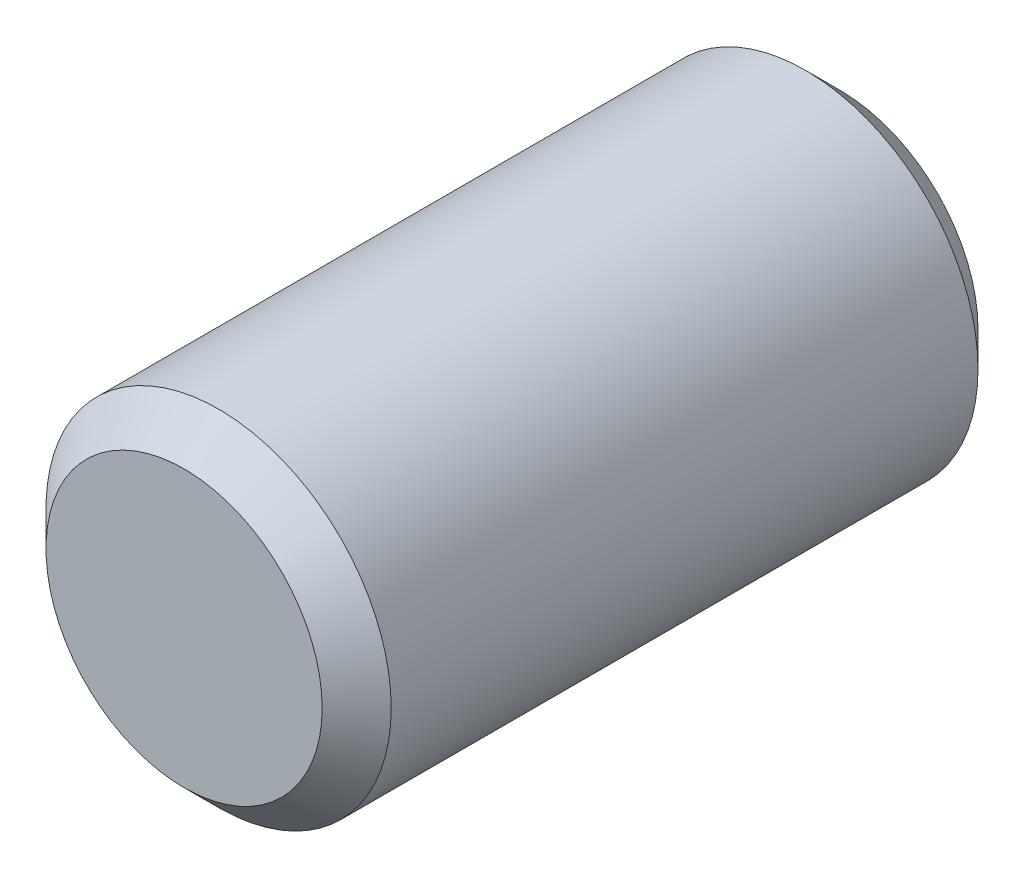
ISO-10303-21;
HEADER;
FILE_DESCRIPTION(('STEP AP214'),'2;1');
FILE_NAME('part.step','',(''),(''),'','','');
FILE_SCHEMA(('AUTOMOTIVE_DESIGN { 1 0 10303 214 1 1 1 1 }'));
ENDSEC;
DATA;
#1=APPLICATION_CONTEXT('core data for automotive mechanical design processes');
#2=APPLICATION_PROTOCOL_DEFINITION('international standard','automotive_design',2000,#1);
#3=PRODUCT_CONTEXT('',#1,'mechanical');
#4=PRODUCT('Part','Part','',(#3));
#5=PRODUCT_RELATED_PRODUCT_CATEGORY('part','',(#4));
#6=PRODUCT_DEFINITION_FORMATION('','',#4);
#7=PRODUCT_DEFINITION_CONTEXT('part definition',#1,'design');
#8=PRODUCT_DEFINITION('design','',#6,#7);
#9=PRODUCT_DEFINITION_SHAPE('','',#8);
#10=(LENGTH_UNIT() NAMED_UNIT(*) SI_UNIT(.MILLI.,.METRE.));
#11=(NAMED_UNIT(*) PLANE_ANGLE_UNIT() SI_UNIT($,.RADIAN.));
#12=(NAMED_UNIT(*) SI_UNIT($,.STERADIAN.) SOLID_ANGLE_UNIT());
#13=UNCERTAINTY_MEASURE_WITH_UNIT(LENGTH_MEASURE(1.E-05),#10,'distance_accuracy_value','');
#14=(GEOMETRIC_REPRESENTATION_CONTEXT(3) GLOBAL_UNCERTAINTY_ASSIGNED_CONTEXT((#13)) GLOBAL_UNIT_ASSIGNED_CONTEXT((#10,
#11,#12)) REPRESENTATION_CONTEXT('',''));
#15=CARTESIAN_POINT('',(0.,0.,0.));
#16=DIRECTION('',(0.,0.,1.));
#17=DIRECTION('',(1.,0.,0.));
#18=AXIS2_PLACEMENT_3D('',#15,#16,#17);
#19=CARTESIAN_POINT('',(0.,0.,190.));
#20=DIRECTION('',(0.,0.,-1.));
#21=DIRECTION('',(-1.,0.,0.));
#22=AXIS2_PLACEMENT_3D('',#19,#20,#21);
#23=CYLINDRICAL_SURFACE('',#22,50.);
#24=CARTESIAN_POINT('',(0.,0.,10.));
#25=DIRECTION('',(0.,0.,1.));
#26=DIRECTION('',(1.,0.,0.));
#27=AXIS2_PLACEMENT_3D('',#24,#25,#26);
#28=CIRCLE('',#27,50.);
#29=CARTESIAN_POINT('',(50.,0.,10.));
#30=VERTEX_POINT('',#29);
#31=EDGE_CURVE('E54',#30,#30,#28,.T.);
#32=ORIENTED_EDGE('',*,*,#31,.T.);
#33=EDGE_LOOP('',(#32));
#34=FACE_BOUND('',#33,.T.);
#35=CARTESIAN_POINT('',(0.,0.,180.));
#36=DIRECTION('',(0.,0.,1.));
#37=DIRECTION('',(1.,0.,0.));
#38=AXIS2_PLACEMENT_3D('',#35,#36,#37);
#39=CIRCLE('',#38,50.);
#40=CARTESIAN_POINT('',(50.,0.,180.));
#41=VERTEX_POINT('',#40);
#42=EDGE_CURVE('E58',#41,#41,#39,.F.);
#43=ORIENTED_EDGE('',*,*,#42,.T.);
#44=EDGE_LOOP('',(#43));
#45=FACE_BOUND('',#44,.T.);
#46=ADVANCED_FACE('F43',(#34,#45),#23,.T.);
#47=CARTESIAN_POINT('',(0.,0.,190.));
#48=DIRECTION('',(0.,0.,1.));
#49=DIRECTION('',(1.,0.,0.));
#50=AXIS2_PLACEMENT_3D('',#47,#48,#49);
#51=PLANE('',#50);
#52=CARTESIAN_POINT('',(0.,0.,190.));
#53=DIRECTION('',(0.,0.,1.));
#54=DIRECTION('',(1.,0.,0.));
#55=AXIS2_PLACEMENT_3D('',#52,#53,#54);
#56=CIRCLE('',#55,40.);
#57=CARTESIAN_POINT('',(40.,0.,190.));
#58=VERTEX_POINT('',#57);
#59=EDGE_CURVE('E12',#58,#58,#56,.T.);
#60=ORIENTED_EDGE('',*,*,#59,.T.);
#61=EDGE_LOOP('',(#60));
#62=FACE_BOUND('',#61,.T.);
#63=ADVANCED_FACE('F74',(#62),#51,.T.);
#64=CARTESIAN_POINT('',(0.,0.,0.));
#65=DIRECTION('',(0.,0.,1.));
#66=DIRECTION('',(1.,0.,0.));
#67=AXIS2_PLACEMENT_3D('',#64,#65,#66);
#68=PLANE('',#67);
#69=CARTESIAN_POINT('',(0.,0.,0.));
#70=DIRECTION('',(0.,0.,1.));
#71=DIRECTION('',(1.,0.,0.));
#72=AXIS2_PLACEMENT_3D('',#69,#70,#71);
#73=CIRCLE('',#72,40.);
#74=CARTESIAN_POINT('',(40.,0.,0.));
#75=VERTEX_POINT('',#74);
#76=EDGE_CURVE('E50',#75,#75,#73,.F.);
#77=ORIENTED_EDGE('',*,*,#76,.T.);
#78=EDGE_LOOP('',(#77));
#79=FACE_BOUND('',#78,.T.);
#80=ADVANCED_FACE('F71',(#79),#68,.F.);
#81=CARTESIAN_POINT('',(0.,0.,10.));
#82=DIRECTION('',(0.,0.,1.));
#83=DIRECTION('',(1.,0.,0.));
#84=AXIS2_PLACEMENT_3D('',#81,#82,#83);
#85=CONICAL_SURFACE('',#84,50.,0.78539816339745);
#86=ORIENTED_EDGE('',*,*,#76,.F.);
#87=EDGE_LOOP('',(#86));
#88=FACE_BOUND('',#87,.T.);
#89=ORIENTED_EDGE('',*,*,#31,.F.);
#90=EDGE_LOOP('',(#89));
#91=FACE_BOUND('',#90,.T.);
#92=ADVANCED_FACE('F67',(#88,#91),#85,.T.);
#93=CARTESIAN_POINT('',(0.,0.,190.));
#94=DIRECTION('',(0.,0.,-1.));
#95=DIRECTION('',(-1.,0.,0.));
#96=AXIS2_PLACEMENT_3D('',#93,#94,#95);
#97=CONICAL_SURFACE('',#96,40.,0.785398163397446);
#98=ORIENTED_EDGE('',*,*,#42,.F.);
#99=EDGE_LOOP('',(#98));
#100=FACE_BOUND('',#99,.T.);
#101=ORIENTED_EDGE('',*,*,#59,.F.);
#102=EDGE_LOOP('',(#101));
#103=FACE_BOUND('',#102,.T.);
#104=ADVANCED_FACE('F45',(#100,#103),#97,.T.);
#105=CLOSED_SHELL('',(#46,#63,#80,#92,#104));
#106=MANIFOLD_SOLID_BREP('B2',#105);
#107=ADVANCED_BREP_SHAPE_REPRESENTATION('',(#18,#106),#14);
#108=SHAPE_DEFINITION_REPRESENTATION(#9,#107);
ENDSEC;
END-ISO-10303-21;
